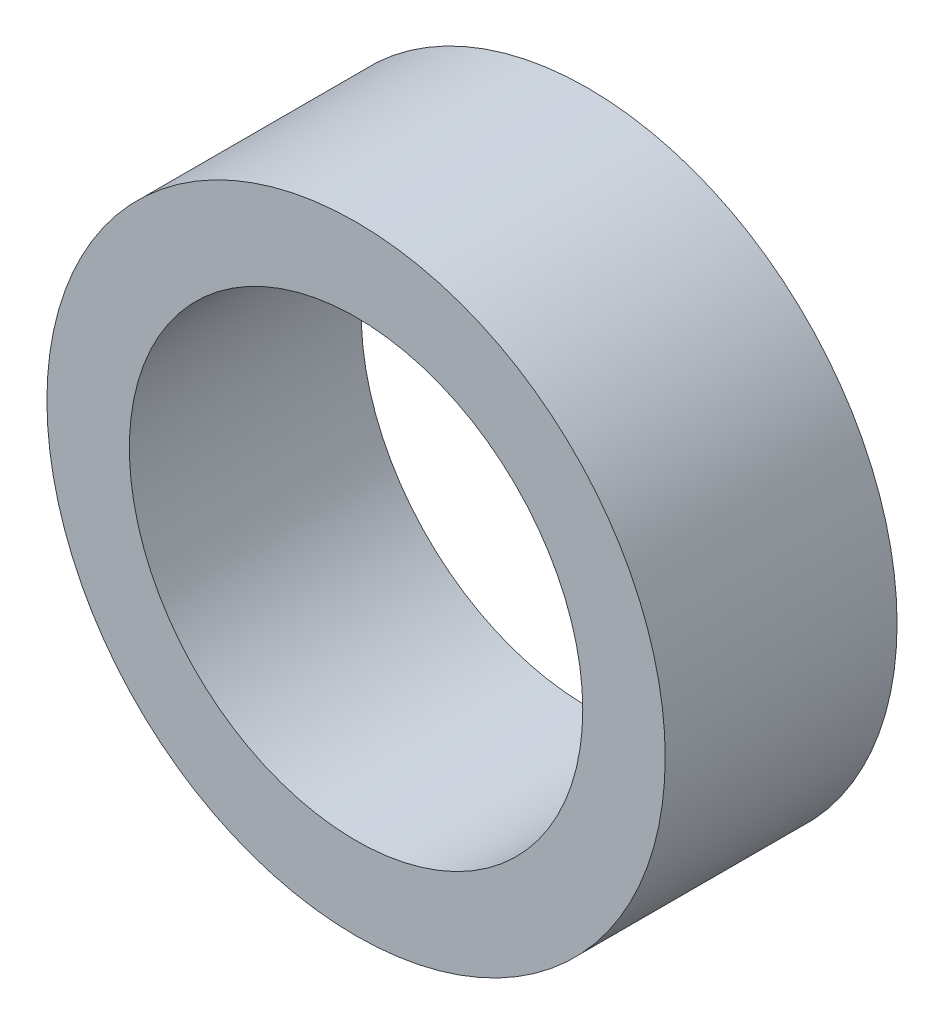
ISO-10303-21;
HEADER;
FILE_DESCRIPTION(('STEP AP214'),'2;1');
FILE_NAME('part.step','',(''),(''),'','','');
FILE_SCHEMA(('AUTOMOTIVE_DESIGN { 1 0 10303 214 1 1 1 1 }'));
ENDSEC;
DATA;
#1=APPLICATION_CONTEXT('core data for automotive mechanical design processes');
#2=APPLICATION_PROTOCOL_DEFINITION('international standard','automotive_design',2000,#1);
#3=PRODUCT_CONTEXT('',#1,'mechanical');
#4=PRODUCT('Part','Part','',(#3));
#5=PRODUCT_RELATED_PRODUCT_CATEGORY('part','',(#4));
#6=PRODUCT_DEFINITION_FORMATION('','',#4);
#7=PRODUCT_DEFINITION_CONTEXT('part definition',#1,'design');
#8=PRODUCT_DEFINITION('design','',#6,#7);
#9=PRODUCT_DEFINITION_SHAPE('','',#8);
#10=(LENGTH_UNIT() NAMED_UNIT(*) SI_UNIT(.MILLI.,.METRE.));
#11=(NAMED_UNIT(*) PLANE_ANGLE_UNIT() SI_UNIT($,.RADIAN.));
#12=(NAMED_UNIT(*) SI_UNIT($,.STERADIAN.) SOLID_ANGLE_UNIT());
#13=UNCERTAINTY_MEASURE_WITH_UNIT(LENGTH_MEASURE(1.E-05),#10,'distance_accuracy_value','');
#14=(GEOMETRIC_REPRESENTATION_CONTEXT(3) GLOBAL_UNCERTAINTY_ASSIGNED_CONTEXT((#13)) GLOBAL_UNIT_ASSIGNED_CONTEXT((#10,
#11,#12)) REPRESENTATION_CONTEXT('',''));
#15=CARTESIAN_POINT('',(0.,0.,0.));
#16=DIRECTION('',(0.,0.,1.));
#17=DIRECTION('',(1.,0.,0.));
#18=AXIS2_PLACEMENT_3D('',#15,#16,#17);
#19=CARTESIAN_POINT('',(81.9327563892023,26.3907322549298,4.5));
#20=DIRECTION('',(0.,0.,1.));
#21=DIRECTION('',(1.,0.,0.));
#22=AXIS2_PLACEMENT_3D('',#19,#20,#21);
#23=PLANE('',#22);
#24=CARTESIAN_POINT('',(81.9327563892023,26.3907322549298,4.5));
#25=DIRECTION('',(0.,0.,1.));
#26=DIRECTION('',(1.,0.,0.));
#27=AXIS2_PLACEMENT_3D('',#24,#25,#26);
#28=CIRCLE('',#27,6.);
#29=CARTESIAN_POINT('',(87.9327563892023,26.3907322549298,4.5));
#30=VERTEX_POINT('',#29);
#31=EDGE_CURVE('E10',#30,#30,#28,.T.);
#32=ORIENTED_EDGE('',*,*,#31,.T.);
#33=EDGE_LOOP('',(#32));
#34=FACE_BOUND('',#33,.T.);
#35=CARTESIAN_POINT('',(81.9327563892023,26.3907322549298,4.5));
#36=DIRECTION('',(0.,0.,1.));
#37=DIRECTION('',(1.,0.,0.));
#38=AXIS2_PLACEMENT_3D('',#35,#36,#37);
#39=CIRCLE('',#38,4.4);
#40=CARTESIAN_POINT('',(86.3327563892023,26.3907322549298,4.5));
#41=VERTEX_POINT('',#40);
#42=EDGE_CURVE('E42',#41,#41,#39,.T.);
#43=ORIENTED_EDGE('',*,*,#42,.F.);
#44=EDGE_LOOP('',(#43));
#45=FACE_BOUND('',#44,.T.);
#46=ADVANCED_FACE('F31',(#34,#45),#23,.T.);
#47=CARTESIAN_POINT('',(81.9327563892023,26.3907322549298,0.));
#48=DIRECTION('',(0.,0.,1.));
#49=DIRECTION('',(1.,0.,0.));
#50=AXIS2_PLACEMENT_3D('',#47,#48,#49);
#51=PLANE('',#50);
#52=CARTESIAN_POINT('',(81.9327563892023,26.3907322549298,0.));
#53=DIRECTION('',(0.,0.,1.));
#54=DIRECTION('',(1.,0.,0.));
#55=AXIS2_PLACEMENT_3D('',#52,#53,#54);
#56=CIRCLE('',#55,6.);
#57=CARTESIAN_POINT('',(87.9327563892023,26.3907322549298,0.));
#58=VERTEX_POINT('',#57);
#59=EDGE_CURVE('E35',#58,#58,#56,.T.);
#60=ORIENTED_EDGE('',*,*,#59,.F.);
#61=EDGE_LOOP('',(#60));
#62=FACE_BOUND('',#61,.T.);
#63=CARTESIAN_POINT('',(81.9327563892023,26.3907322549298,0.));
#64=DIRECTION('',(0.,0.,1.));
#65=DIRECTION('',(1.,0.,0.));
#66=AXIS2_PLACEMENT_3D('',#63,#64,#65);
#67=CIRCLE('',#66,4.4);
#68=CARTESIAN_POINT('',(86.3327563892023,26.3907322549298,0.));
#69=VERTEX_POINT('',#68);
#70=EDGE_CURVE('E44',#69,#69,#67,.T.);
#71=ORIENTED_EDGE('',*,*,#70,.T.);
#72=EDGE_LOOP('',(#71));
#73=FACE_BOUND('',#72,.T.);
#74=ADVANCED_FACE('F54',(#62,#73),#51,.F.);
#75=CARTESIAN_POINT('',(81.9327563892023,26.3907322549298,4.5));
#76=DIRECTION('',(0.,0.,-1.));
#77=DIRECTION('',(-1.,0.,0.));
#78=AXIS2_PLACEMENT_3D('',#75,#76,#77);
#79=CYLINDRICAL_SURFACE('',#78,6.);
#80=ORIENTED_EDGE('',*,*,#31,.F.);
#81=EDGE_LOOP('',(#80));
#82=FACE_BOUND('',#81,.T.);
#83=ORIENTED_EDGE('',*,*,#59,.T.);
#84=EDGE_LOOP('',(#83));
#85=FACE_BOUND('',#84,.T.);
#86=ADVANCED_FACE('F33',(#82,#85),#79,.T.);
#87=CARTESIAN_POINT('',(81.9327563892023,26.3907322549298,4.5));
#88=DIRECTION('',(0.,0.,-1.));
#89=DIRECTION('',(-1.,0.,0.));
#90=AXIS2_PLACEMENT_3D('',#87,#88,#89);
#91=CYLINDRICAL_SURFACE('',#90,4.4);
#92=ORIENTED_EDGE('',*,*,#42,.T.);
#93=EDGE_LOOP('',(#92));
#94=FACE_BOUND('',#93,.T.);
#95=ORIENTED_EDGE('',*,*,#70,.F.);
#96=EDGE_LOOP('',(#95));
#97=FACE_BOUND('',#96,.T.);
#98=ADVANCED_FACE('F50',(#94,#97),#91,.F.);
#99=CLOSED_SHELL('',(#46,#74,#86,#98));
#100=MANIFOLD_SOLID_BREP('B2',#99);
#101=ADVANCED_BREP_SHAPE_REPRESENTATION('',(#18,#100),#14);
#102=SHAPE_DEFINITION_REPRESENTATION(#9,#101);
ENDSEC;
END-ISO-10303-21;
